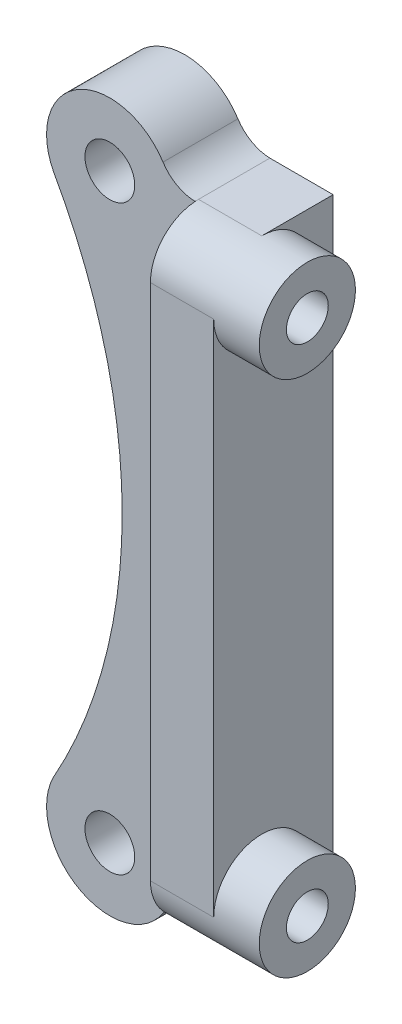
ISO-10303-21;
HEADER;
FILE_DESCRIPTION(('STEP AP214'),'2;1');
FILE_NAME('part.step','',(''),(''),'','','');
FILE_SCHEMA(('AUTOMOTIVE_DESIGN { 1 0 10303 214 1 1 1 1 }'));
ENDSEC;
DATA;
#1=APPLICATION_CONTEXT('core data for automotive mechanical design processes');
#2=APPLICATION_PROTOCOL_DEFINITION('international standard','automotive_design',2000,#1);
#3=PRODUCT_CONTEXT('',#1,'mechanical');
#4=PRODUCT('Part','Part','',(#3));
#5=PRODUCT_RELATED_PRODUCT_CATEGORY('part','',(#4));
#6=PRODUCT_DEFINITION_FORMATION('','',#4);
#7=PRODUCT_DEFINITION_CONTEXT('part definition',#1,'design');
#8=PRODUCT_DEFINITION('design','',#6,#7);
#9=PRODUCT_DEFINITION_SHAPE('','',#8);
#10=(LENGTH_UNIT() NAMED_UNIT(*) SI_UNIT(.MILLI.,.METRE.));
#11=(NAMED_UNIT(*) PLANE_ANGLE_UNIT() SI_UNIT($,.RADIAN.));
#12=(NAMED_UNIT(*) SI_UNIT($,.STERADIAN.) SOLID_ANGLE_UNIT());
#13=UNCERTAINTY_MEASURE_WITH_UNIT(LENGTH_MEASURE(1.E-05),#10,'distance_accuracy_value','');
#14=(GEOMETRIC_REPRESENTATION_CONTEXT(3) GLOBAL_UNCERTAINTY_ASSIGNED_CONTEXT((#13)) GLOBAL_UNIT_ASSIGNED_CONTEXT((#10,
#11,#12)) REPRESENTATION_CONTEXT('',''));
#15=CARTESIAN_POINT('',(0.,0.,0.));
#16=DIRECTION('',(0.,0.,1.));
#17=DIRECTION('',(1.,0.,0.));
#18=AXIS2_PLACEMENT_3D('',#15,#16,#17);
#19=CARTESIAN_POINT('',(27.305,-64.9986,0.));
#20=DIRECTION('',(1.,0.,0.));
#21=DIRECTION('',(0.,0.,-1.));
#22=AXIS2_PLACEMENT_3D('',#19,#20,#21);
#23=PLANE('',#22);
#24=CARTESIAN_POINT('',(27.305,-64.9986,0.));
#25=DIRECTION('',(-1.,0.,0.));
#26=DIRECTION('',(0.,0.,-1.));
#27=AXIS2_PLACEMENT_3D('',#24,#25,#26);
#28=CIRCLE('',#27,12.065);
#29=CARTESIAN_POINT('',(27.305,-64.9986,-12.065));
#30=VERTEX_POINT('',#29);
#31=EDGE_CURVE('E195',#30,#30,#28,.T.);
#32=ORIENTED_EDGE('',*,*,#31,.F.);
#33=EDGE_LOOP('',(#32));
#34=FACE_BOUND('',#33,.T.);
#35=CARTESIAN_POINT('',(27.305,-64.9986,0.));
#36=DIRECTION('',(-1.,0.,0.));
#37=DIRECTION('',(0.,0.,-1.));
#38=AXIS2_PLACEMENT_3D('',#35,#36,#37);
#39=CIRCLE('',#38,5.25018);
#40=CARTESIAN_POINT('',(27.305,-64.9986,-5.25018));
#41=VERTEX_POINT('',#40);
#42=EDGE_CURVE('E521',#41,#41,#39,.T.);
#43=ORIENTED_EDGE('',*,*,#42,.T.);
#44=EDGE_LOOP('',(#43));
#45=FACE_BOUND('',#44,.T.);
#46=ADVANCED_FACE('F31',(#34,#45),#23,.T.);
#47=CARTESIAN_POINT('',(15.875,-77.0636,-17.907));
#48=DIRECTION('',(0.,0.,1.));
#49=DIRECTION('',(1.,0.,0.));
#50=AXIS2_PLACEMENT_3D('',#47,#48,#49);
#51=PLANE('',#50);
#52=DIRECTION('',(-1.,0.,0.));
#53=VECTOR('',#52,1.);
#54=CARTESIAN_POINT('',(15.875,-77.0636,-17.907));
#55=LINE('',#54,#53);
#56=CARTESIAN_POINT('',(15.875,-77.0636,-17.907));
#57=VERTEX_POINT('',#56);
#58=CARTESIAN_POINT('',(0.,-77.0636,-17.907));
#59=VERTEX_POINT('',#58);
#60=EDGE_CURVE('E269',#57,#59,#55,.T.);
#61=ORIENTED_EDGE('',*,*,#60,.T.);
#62=CARTESIAN_POINT('',(0.304239616629049,-86.9551981825839,-17.907));
#63=DIRECTION('',(0.,0.,-1.));
#64=DIRECTION('',(-1.,0.,0.));
#65=AXIS2_PLACEMENT_3D('',#62,#63,#64);
#66=CIRCLE('',#65,9.89627588287756);
#67=CARTESIAN_POINT('',(-8.01545506203511,-81.5961911100162,-17.907));
#68=VERTEX_POINT('',#67);
#69=EDGE_CURVE('E178',#59,#68,#66,.F.);
#70=ORIENTED_EDGE('',*,*,#69,.T.);
#71=CARTESIAN_POINT('',(-21.3614,-72.9996,-17.907));
#72=DIRECTION('',(0.,0.,-1.));
#73=DIRECTION('',(-1.,0.,0.));
#74=AXIS2_PLACEMENT_3D('',#71,#72,#73);
#75=CIRCLE('',#74,15.875);
#76=CARTESIAN_POINT('',(-35.4880712580159,-65.7571705617556,-17.907));
#77=VERTEX_POINT('',#76);
#78=EDGE_CURVE('E140',#68,#77,#75,.T.);
#79=ORIENTED_EDGE('',*,*,#78,.T.);
#80=CARTESIAN_POINT('',(-152.4,0.,-17.907));
#81=DIRECTION('',(0.,0.,-1.));
#82=DIRECTION('',(-1.,0.,0.));
#83=AXIS2_PLACEMENT_3D('',#80,#81,#82);
#84=CIRCLE('',#83,134.135769138804);
#85=CARTESIAN_POINT('',(-35.4880712580154,65.7571705617547,-17.907));
#86=VERTEX_POINT('',#85);
#87=EDGE_CURVE('E181',#86,#77,#84,.T.);
#88=ORIENTED_EDGE('',*,*,#87,.F.);
#89=CARTESIAN_POINT('',(-21.3614,72.9996,-17.907));
#90=DIRECTION('',(0.,0.,-1.));
#91=DIRECTION('',(-1.,0.,0.));
#92=AXIS2_PLACEMENT_3D('',#89,#90,#91);
#93=CIRCLE('',#92,15.875);
#94=CARTESIAN_POINT('',(-8.01545506203512,81.5961911100162,-17.907));
#95=VERTEX_POINT('',#94);
#96=EDGE_CURVE('E166',#86,#95,#93,.T.);
#97=ORIENTED_EDGE('',*,*,#96,.T.);
#98=CARTESIAN_POINT('',(0.304239616629049,86.9551981825839,-17.907));
#99=DIRECTION('',(0.,0.,-1.));
#100=DIRECTION('',(-1.,0.,0.));
#101=AXIS2_PLACEMENT_3D('',#98,#99,#100);
#102=CIRCLE('',#101,9.89627588287755);
#103=CARTESIAN_POINT('',(0.,77.0636,-17.907));
#104=VERTEX_POINT('',#103);
#105=EDGE_CURVE('E163',#104,#95,#102,.T.);
#106=ORIENTED_EDGE('',*,*,#105,.F.);
#107=DIRECTION('',(-1.,0.,0.));
#108=VECTOR('',#107,1.);
#109=CARTESIAN_POINT('',(15.875,77.0636,-17.907));
#110=LINE('',#109,#108);
#111=CARTESIAN_POINT('',(15.875,77.0636,-17.907));
#112=VERTEX_POINT('',#111);
#113=EDGE_CURVE('E238',#112,#104,#110,.T.);
#114=ORIENTED_EDGE('',*,*,#113,.F.);
#115=DIRECTION('',(0.,1.,0.));
#116=VECTOR('',#115,1.);
#117=CARTESIAN_POINT('',(15.875,-77.0636,-17.907));
#118=LINE('',#117,#116);
#119=EDGE_CURVE('E92',#57,#112,#118,.T.);
#120=ORIENTED_EDGE('',*,*,#119,.F.);
#121=EDGE_LOOP('',(#61,#70,#79,#88,#97,#106,#114,#120));
#122=FACE_BOUND('',#121,.T.);
#123=CARTESIAN_POINT('',(-21.3614,72.9996,-17.907));
#124=DIRECTION('',(0.,0.,1.));
#125=DIRECTION('',(1.,0.,0.));
#126=AXIS2_PLACEMENT_3D('',#123,#124,#125);
#127=CIRCLE('',#126,6.2484);
#128=CARTESIAN_POINT('',(-15.113,72.9996,-17.907));
#129=VERTEX_POINT('',#128);
#130=EDGE_CURVE('E169',#129,#129,#127,.T.);
#131=ORIENTED_EDGE('',*,*,#130,.T.);
#132=EDGE_LOOP('',(#131));
#133=FACE_BOUND('',#132,.T.);
#134=CARTESIAN_POINT('',(-21.3614,-72.9996,-17.907));
#135=DIRECTION('',(0.,0.,1.));
#136=DIRECTION('',(1.,0.,0.));
#137=AXIS2_PLACEMENT_3D('',#134,#135,#136);
#138=CIRCLE('',#137,6.2484);
#139=CARTESIAN_POINT('',(-15.113,-72.9996,-17.907));
#140=VERTEX_POINT('',#139);
#141=EDGE_CURVE('E524',#140,#140,#138,.F.);
#142=ORIENTED_EDGE('',*,*,#141,.F.);
#143=EDGE_LOOP('',(#142));
#144=FACE_BOUND('',#143,.T.);
#145=ADVANCED_FACE('F266',(#122,#133,#144),#51,.F.);
#146=CARTESIAN_POINT('',(-155.118473842754,0.,0.889000000000001));
#147=DIRECTION('',(0.,0.,-1.));
#148=DIRECTION('',(-1.,0.,0.));
#149=AXIS2_PLACEMENT_3D('',#146,#147,#148);
#150=PLANE('',#149);
#151=CARTESIAN_POINT('',(0.304239616629049,-86.9551981825839,0.889000000000001));
#152=DIRECTION('',(0.,0.,-1.));
#153=DIRECTION('',(-1.,0.,0.));
#154=AXIS2_PLACEMENT_3D('',#151,#152,#153);
#155=CIRCLE('',#154,9.89627588287756);
#156=CARTESIAN_POINT('',(0.,-77.0636,0.889000000000001));
#157=VERTEX_POINT('',#156);
#158=CARTESIAN_POINT('',(-8.01545506203511,-81.5961911100162,0.889000000000001));
#159=VERTEX_POINT('',#158);
#160=EDGE_CURVE('E152',#157,#159,#155,.F.);
#161=ORIENTED_EDGE('',*,*,#160,.F.);
#162=DIRECTION('',(0.,1.,0.));
#163=VECTOR('',#162,1.);
#164=CARTESIAN_POINT('',(0.,0.,0.889000000000001));
#165=LINE('',#164,#163);
#166=CARTESIAN_POINT('',(0.,-77.0308027908442,0.889000000000001));
#167=VERTEX_POINT('',#166);
#168=EDGE_CURVE('E43',#157,#167,#165,.T.);
#169=ORIENTED_EDGE('',*,*,#168,.T.);
#170=CARTESIAN_POINT('',(0.,77.0308027908442,0.889000000000001));
#171=VERTEX_POINT('',#170);
#172=EDGE_CURVE('E11',#167,#171,#165,.T.);
#173=ORIENTED_EDGE('',*,*,#172,.T.);
#174=CARTESIAN_POINT('',(0.,77.0636,0.889000000000001));
#175=VERTEX_POINT('',#174);
#176=EDGE_CURVE('E44',#171,#175,#165,.T.);
#177=ORIENTED_EDGE('',*,*,#176,.T.);
#178=CARTESIAN_POINT('',(0.304239616629049,86.9551981825839,0.889000000000001));
#179=DIRECTION('',(0.,0.,-1.));
#180=DIRECTION('',(-1.,0.,0.));
#181=AXIS2_PLACEMENT_3D('',#178,#179,#180);
#182=CIRCLE('',#181,9.89627588287755);
#183=CARTESIAN_POINT('',(-8.01545506203512,81.5961911100162,0.889000000000001));
#184=VERTEX_POINT('',#183);
#185=EDGE_CURVE('E176',#175,#184,#182,.T.);
#186=ORIENTED_EDGE('',*,*,#185,.T.);
#187=CARTESIAN_POINT('',(-21.3614,72.9996,0.889000000000001));
#188=DIRECTION('',(0.,0.,-1.));
#189=DIRECTION('',(-1.,0.,0.));
#190=AXIS2_PLACEMENT_3D('',#187,#188,#189);
#191=CIRCLE('',#190,15.875);
#192=CARTESIAN_POINT('',(-35.4880712580154,65.7571705617547,0.889000000000001));
#193=VERTEX_POINT('',#192);
#194=EDGE_CURVE('E173',#193,#184,#191,.T.);
#195=ORIENTED_EDGE('',*,*,#194,.F.);
#196=CARTESIAN_POINT('',(-152.4,0.,0.889000000000001));
#197=DIRECTION('',(0.,0.,-1.));
#198=DIRECTION('',(-1.,0.,0.));
#199=AXIS2_PLACEMENT_3D('',#196,#197,#198);
#200=CIRCLE('',#199,134.135769138804);
#201=CARTESIAN_POINT('',(-35.4880712580159,-65.7571705617556,0.889000000000001));
#202=VERTEX_POINT('',#201);
#203=EDGE_CURVE('E155',#193,#202,#200,.T.);
#204=ORIENTED_EDGE('',*,*,#203,.T.);
#205=CARTESIAN_POINT('',(-21.3614,-72.9996,0.889000000000001));
#206=DIRECTION('',(0.,0.,-1.));
#207=DIRECTION('',(-1.,0.,0.));
#208=AXIS2_PLACEMENT_3D('',#205,#206,#207);
#209=CIRCLE('',#208,15.875);
#210=EDGE_CURVE('E138',#159,#202,#209,.T.);
#211=ORIENTED_EDGE('',*,*,#210,.F.);
#212=EDGE_LOOP('',(#161,#169,#173,#177,#186,#195,#204,#211));
#213=FACE_BOUND('',#212,.T.);
#214=CARTESIAN_POINT('',(-21.3614,72.9996,0.889000000000001));
#215=DIRECTION('',(0.,0.,1.));
#216=DIRECTION('',(1.,0.,0.));
#217=AXIS2_PLACEMENT_3D('',#214,#215,#216);
#218=CIRCLE('',#217,6.2484);
#219=CARTESIAN_POINT('',(-15.113,72.9996,0.889000000000001));
#220=VERTEX_POINT('',#219);
#221=EDGE_CURVE('E535',#220,#220,#218,.T.);
#222=ORIENTED_EDGE('',*,*,#221,.F.);
#223=EDGE_LOOP('',(#222));
#224=FACE_BOUND('',#223,.T.);
#225=CARTESIAN_POINT('',(-21.3614,-72.9996,0.889000000000001));
#226=DIRECTION('',(0.,0.,-1.));
#227=DIRECTION('',(1.,0.,0.));
#228=AXIS2_PLACEMENT_3D('',#225,#226,#227);
#229=CIRCLE('',#228,6.2484);
#230=CARTESIAN_POINT('',(-15.113,-72.9996,0.889000000000001));
#231=VERTEX_POINT('',#230);
#232=EDGE_CURVE('E520',#231,#231,#229,.T.);
#233=ORIENTED_EDGE('',*,*,#232,.T.);
#234=EDGE_LOOP('',(#233));
#235=FACE_BOUND('',#234,.T.);
#236=ADVANCED_FACE('F149',(#213,#224,#235),#150,.F.);
#237=CARTESIAN_POINT('',(15.875,-64.9986,0.));
#238=DIRECTION('',(-1.,0.,0.));
#239=DIRECTION('',(0.,0.,1.));
#240=AXIS2_PLACEMENT_3D('',#237,#238,#239);
#241=PLANE('',#240);
#242=DIRECTION('',(0.,-1.,0.));
#243=VECTOR('',#242,1.);
#244=CARTESIAN_POINT('',(15.875,-64.9986,12.065));
#245=LINE('',#244,#243);
#246=CARTESIAN_POINT('',(15.875,64.9986,12.065));
#247=VERTEX_POINT('',#246);
#248=CARTESIAN_POINT('',(15.875,-64.9986,12.065));
#249=VERTEX_POINT('',#248);
#250=EDGE_CURVE('E58',#247,#249,#245,.T.);
#251=ORIENTED_EDGE('',*,*,#250,.T.);
#252=CARTESIAN_POINT('',(15.875,-64.9986,0.));
#253=DIRECTION('',(-1.,0.,0.));
#254=DIRECTION('',(0.,0.,-1.));
#255=AXIS2_PLACEMENT_3D('',#252,#253,#254);
#256=CIRCLE('',#255,12.065);
#257=CARTESIAN_POINT('',(15.875,-77.0636,0.));
#258=VERTEX_POINT('',#257);
#259=EDGE_CURVE('E193',#249,#258,#256,.T.);
#260=ORIENTED_EDGE('',*,*,#259,.T.);
#261=DIRECTION('',(0.,0.,-1.));
#262=VECTOR('',#261,1.);
#263=CARTESIAN_POINT('',(15.875,-77.0636,-17.907));
#264=LINE('',#263,#262);
#265=EDGE_CURVE('E203',#258,#57,#264,.T.);
#266=ORIENTED_EDGE('',*,*,#265,.T.);
#267=ORIENTED_EDGE('',*,*,#119,.T.);
#268=DIRECTION('',(0.,0.,1.));
#269=VECTOR('',#268,1.);
#270=CARTESIAN_POINT('',(15.875,77.0636,-17.907));
#271=LINE('',#270,#269);
#272=CARTESIAN_POINT('',(15.875,77.0636,0.));
#273=VERTEX_POINT('',#272);
#274=EDGE_CURVE('E206',#112,#273,#271,.T.);
#275=ORIENTED_EDGE('',*,*,#274,.T.);
#276=CARTESIAN_POINT('',(15.875,64.9986,0.));
#277=DIRECTION('',(1.,0.,0.));
#278=DIRECTION('',(0.,0.,-1.));
#279=AXIS2_PLACEMENT_3D('',#276,#277,#278);
#280=CIRCLE('',#279,12.065);
#281=EDGE_CURVE('E41',#247,#273,#280,.T.);
#282=ORIENTED_EDGE('',*,*,#281,.F.);
#283=EDGE_LOOP('',(#251,#260,#266,#267,#275,#282));
#284=FACE_BOUND('',#283,.T.);
#285=ADVANCED_FACE('F318',(#284),#241,.F.);
#286=CARTESIAN_POINT('',(15.875,-77.0636,-17.907));
#287=DIRECTION('',(0.,1.,0.));
#288=DIRECTION('',(0.,0.,1.));
#289=AXIS2_PLACEMENT_3D('',#286,#287,#288);
#290=PLANE('',#289);
#291=DIRECTION('',(0.,0.,-1.));
#292=VECTOR('',#291,1.);
#293=CARTESIAN_POINT('',(0.,-77.0636,-17.907));
#294=LINE('',#293,#292);
#295=CARTESIAN_POINT('',(0.,-77.0636,0.));
#296=VERTEX_POINT('',#295);
#297=EDGE_CURVE('E202',#296,#59,#294,.T.);
#298=ORIENTED_EDGE('',*,*,#297,.T.);
#299=ORIENTED_EDGE('',*,*,#60,.F.);
#300=ORIENTED_EDGE('',*,*,#265,.F.);
#301=DIRECTION('',(-1.,0.,0.));
#302=VECTOR('',#301,1.);
#303=CARTESIAN_POINT('',(15.875,-77.0636,0.));
#304=LINE('',#303,#302);
#305=EDGE_CURVE('E222',#258,#296,#304,.T.);
#306=ORIENTED_EDGE('',*,*,#305,.T.);
#307=EDGE_LOOP('',(#298,#299,#300,#306));
#308=FACE_BOUND('',#307,.T.);
#309=ADVANCED_FACE('F33',(#308),#290,.F.);
#310=CARTESIAN_POINT('',(15.875,77.0636,-17.907));
#311=DIRECTION('',(0.,-1.,0.));
#312=DIRECTION('',(0.,0.,-1.));
#313=AXIS2_PLACEMENT_3D('',#310,#311,#312);
#314=PLANE('',#313);
#315=DIRECTION('',(0.,0.,1.));
#316=VECTOR('',#315,1.);
#317=CARTESIAN_POINT('',(0.,77.0636,-17.907));
#318=LINE('',#317,#316);
#319=CARTESIAN_POINT('',(0.,77.0636,0.));
#320=VERTEX_POINT('',#319);
#321=EDGE_CURVE('E210',#104,#320,#318,.T.);
#322=ORIENTED_EDGE('',*,*,#321,.T.);
#323=DIRECTION('',(-1.,0.,0.));
#324=VECTOR('',#323,1.);
#325=CARTESIAN_POINT('',(15.875,77.0636,0.));
#326=LINE('',#325,#324);
#327=EDGE_CURVE('E236',#273,#320,#326,.T.);
#328=ORIENTED_EDGE('',*,*,#327,.F.);
#329=ORIENTED_EDGE('',*,*,#274,.F.);
#330=ORIENTED_EDGE('',*,*,#113,.T.);
#331=EDGE_LOOP('',(#322,#328,#329,#330));
#332=FACE_BOUND('',#331,.T.);
#333=ADVANCED_FACE('F234',(#332),#314,.F.);
#334=CARTESIAN_POINT('',(15.875,64.9986,0.));
#335=DIRECTION('',(-1.,0.,0.));
#336=DIRECTION('',(0.,0.,1.));
#337=AXIS2_PLACEMENT_3D('',#334,#335,#336);
#338=CYLINDRICAL_SURFACE('',#337,12.065);
#339=CARTESIAN_POINT('',(0.,64.9986,0.));
#340=DIRECTION('',(1.,0.,0.));
#341=DIRECTION('',(0.,0.,-1.));
#342=AXIS2_PLACEMENT_3D('',#339,#340,#341);
#343=CIRCLE('',#342,12.065);
#344=EDGE_CURVE('E35',#320,#171,#343,.T.);
#345=ORIENTED_EDGE('',*,*,#344,.T.);
#346=CARTESIAN_POINT('',(0.,64.9986,12.065));
#347=VERTEX_POINT('',#346);
#348=EDGE_CURVE('E207',#171,#347,#343,.T.);
#349=ORIENTED_EDGE('',*,*,#348,.T.);
#350=DIRECTION('',(-1.,0.,0.));
#351=VECTOR('',#350,1.);
#352=CARTESIAN_POINT('',(15.875,64.9986,12.065));
#353=LINE('',#352,#351);
#354=EDGE_CURVE('E248',#247,#347,#353,.T.);
#355=ORIENTED_EDGE('',*,*,#354,.F.);
#356=ORIENTED_EDGE('',*,*,#281,.T.);
#357=ORIENTED_EDGE('',*,*,#327,.T.);
#358=EDGE_LOOP('',(#345,#349,#355,#356,#357));
#359=FACE_BOUND('',#358,.T.);
#360=CARTESIAN_POINT('',(27.305,64.9986,0.));
#361=DIRECTION('',(1.,0.,0.));
#362=DIRECTION('',(0.,0.,-1.));
#363=AXIS2_PLACEMENT_3D('',#360,#361,#362);
#364=CIRCLE('',#363,12.065);
#365=CARTESIAN_POINT('',(27.305,64.9986,-12.065));
#366=VERTEX_POINT('',#365);
#367=EDGE_CURVE('E198',#366,#366,#364,.T.);
#368=ORIENTED_EDGE('',*,*,#367,.F.);
#369=EDGE_LOOP('',(#368));
#370=FACE_BOUND('',#369,.T.);
#371=ADVANCED_FACE('F245',(#359,#370),#338,.T.);
#372=CARTESIAN_POINT('',(15.875,-64.9986,12.065));
#373=DIRECTION('',(0.,0.,-1.));
#374=DIRECTION('',(-1.,0.,0.));
#375=AXIS2_PLACEMENT_3D('',#372,#373,#374);
#376=PLANE('',#375);
#377=DIRECTION('',(0.,-1.,0.));
#378=VECTOR('',#377,1.);
#379=CARTESIAN_POINT('',(0.,-64.9986,12.065));
#380=LINE('',#379,#378);
#381=CARTESIAN_POINT('',(0.,-64.9986,12.065));
#382=VERTEX_POINT('',#381);
#383=EDGE_CURVE('E211',#347,#382,#380,.T.);
#384=ORIENTED_EDGE('',*,*,#383,.T.);
#385=DIRECTION('',(-1.,0.,0.));
#386=VECTOR('',#385,1.);
#387=CARTESIAN_POINT('',(15.875,-64.9986,12.065));
#388=LINE('',#387,#386);
#389=EDGE_CURVE('E215',#249,#382,#388,.T.);
#390=ORIENTED_EDGE('',*,*,#389,.F.);
#391=ORIENTED_EDGE('',*,*,#250,.F.);
#392=ORIENTED_EDGE('',*,*,#354,.T.);
#393=EDGE_LOOP('',(#384,#390,#391,#392));
#394=FACE_BOUND('',#393,.T.);
#395=ADVANCED_FACE('F294',(#394),#376,.F.);
#396=CARTESIAN_POINT('',(15.875,-64.9986,0.));
#397=DIRECTION('',(-1.,0.,0.));
#398=DIRECTION('',(0.,0.,1.));
#399=AXIS2_PLACEMENT_3D('',#396,#397,#398);
#400=CYLINDRICAL_SURFACE('',#399,12.065);
#401=CARTESIAN_POINT('',(0.,-64.9986,0.));
#402=DIRECTION('',(1.,0.,0.));
#403=DIRECTION('',(0.,0.,1.));
#404=AXIS2_PLACEMENT_3D('',#401,#402,#403);
#405=CIRCLE('',#404,12.065);
#406=EDGE_CURVE('E205',#382,#167,#405,.T.);
#407=ORIENTED_EDGE('',*,*,#406,.T.);
#408=EDGE_CURVE('E85',#167,#296,#405,.T.);
#409=ORIENTED_EDGE('',*,*,#408,.T.);
#410=ORIENTED_EDGE('',*,*,#305,.F.);
#411=ORIENTED_EDGE('',*,*,#259,.F.);
#412=ORIENTED_EDGE('',*,*,#389,.T.);
#413=EDGE_LOOP('',(#407,#409,#410,#411,#412));
#414=FACE_BOUND('',#413,.T.);
#415=ORIENTED_EDGE('',*,*,#31,.T.);
#416=EDGE_LOOP('',(#415));
#417=FACE_BOUND('',#416,.T.);
#418=ADVANCED_FACE('F291',(#414,#417),#400,.T.);
#419=CARTESIAN_POINT('',(0.,-64.9986,0.));
#420=DIRECTION('',(-1.,0.,0.));
#421=DIRECTION('',(0.,0.,1.));
#422=AXIS2_PLACEMENT_3D('',#419,#420,#421);
#423=PLANE('',#422);
#424=ORIENTED_EDGE('',*,*,#172,.F.);
#425=ORIENTED_EDGE('',*,*,#406,.F.);
#426=ORIENTED_EDGE('',*,*,#383,.F.);
#427=ORIENTED_EDGE('',*,*,#348,.F.);
#428=EDGE_LOOP('',(#424,#425,#426,#427));
#429=FACE_BOUND('',#428,.T.);
#430=ADVANCED_FACE('F293',(#429),#423,.T.);
#431=CARTESIAN_POINT('',(27.305,64.9986,0.));
#432=DIRECTION('',(1.,0.,0.));
#433=DIRECTION('',(0.,0.,-1.));
#434=AXIS2_PLACEMENT_3D('',#431,#432,#433);
#435=PLANE('',#434);
#436=CARTESIAN_POINT('',(27.305,64.9986,0.));
#437=DIRECTION('',(1.,0.,0.));
#438=DIRECTION('',(0.,0.,-1.));
#439=AXIS2_PLACEMENT_3D('',#436,#437,#438);
#440=CIRCLE('',#439,5.25018);
#441=CARTESIAN_POINT('',(27.305,64.9986,-5.25018));
#442=VERTEX_POINT('',#441);
#443=EDGE_CURVE('E531',#442,#442,#440,.T.);
#444=ORIENTED_EDGE('',*,*,#443,.F.);
#445=EDGE_LOOP('',(#444));
#446=FACE_BOUND('',#445,.T.);
#447=ORIENTED_EDGE('',*,*,#367,.T.);
#448=EDGE_LOOP('',(#447));
#449=FACE_BOUND('',#448,.T.);
#450=ADVANCED_FACE('F314',(#446,#449),#435,.T.);
#451=CARTESIAN_POINT('',(0.,0.,0.889000000000001));
#452=DIRECTION('',(-1.,0.,0.));
#453=DIRECTION('',(0.,0.,1.));
#454=AXIS2_PLACEMENT_3D('',#451,#452,#453);
#455=PLANE('',#454);
#456=ORIENTED_EDGE('',*,*,#408,.F.);
#457=ORIENTED_EDGE('',*,*,#168,.F.);
#458=DIRECTION('',(0.,0.,-1.));
#459=VECTOR('',#458,1.);
#460=CARTESIAN_POINT('',(0.,-77.0636,0.889000000000001));
#461=LINE('',#460,#459);
#462=EDGE_CURVE('E161',#157,#296,#461,.T.);
#463=ORIENTED_EDGE('',*,*,#462,.T.);
#464=EDGE_LOOP('',(#456,#457,#463));
#465=FACE_BOUND('',#464,.T.);
#466=ADVANCED_FACE('F272',(#465),#455,.F.);
#467=CARTESIAN_POINT('',(0.304239616629049,-86.9551981825839,0.889000000000001));
#468=DIRECTION('',(0.,0.,-1.));
#469=DIRECTION('',(-1.,0.,0.));
#470=AXIS2_PLACEMENT_3D('',#467,#468,#469);
#471=CYLINDRICAL_SURFACE('',#470,9.89627588287756);
#472=ORIENTED_EDGE('',*,*,#69,.F.);
#473=ORIENTED_EDGE('',*,*,#297,.F.);
#474=ORIENTED_EDGE('',*,*,#462,.F.);
#475=ORIENTED_EDGE('',*,*,#160,.T.);
#476=DIRECTION('',(0.,0.,-1.));
#477=VECTOR('',#476,1.);
#478=CARTESIAN_POINT('',(-8.01545506203511,-81.5961911100162,0.889000000000001));
#479=LINE('',#478,#477);
#480=EDGE_CURVE('E135',#159,#68,#479,.T.);
#481=ORIENTED_EDGE('',*,*,#480,.T.);
#482=EDGE_LOOP('',(#472,#473,#474,#475,#481));
#483=FACE_BOUND('',#482,.T.);
#484=ADVANCED_FACE('F158',(#483),#471,.F.);
#485=ORIENTED_EDGE('',*,*,#344,.F.);
#486=DIRECTION('',(0.,0.,-1.));
#487=VECTOR('',#486,1.);
#488=CARTESIAN_POINT('',(0.,77.0636,0.889000000000001));
#489=LINE('',#488,#487);
#490=EDGE_CURVE('E194',#175,#320,#489,.T.);
#491=ORIENTED_EDGE('',*,*,#490,.F.);
#492=ORIENTED_EDGE('',*,*,#176,.F.);
#493=EDGE_LOOP('',(#485,#491,#492));
#494=FACE_BOUND('',#493,.T.);
#495=ADVANCED_FACE('F253',(#494),#455,.F.);
#496=CARTESIAN_POINT('',(0.304239616629049,86.9551981825839,0.889000000000001));
#497=DIRECTION('',(0.,0.,-1.));
#498=DIRECTION('',(-1.,0.,0.));
#499=AXIS2_PLACEMENT_3D('',#496,#497,#498);
#500=CYLINDRICAL_SURFACE('',#499,9.89627588287755);
#501=ORIENTED_EDGE('',*,*,#105,.T.);
#502=DIRECTION('',(0.,0.,-1.));
#503=VECTOR('',#502,1.);
#504=CARTESIAN_POINT('',(-8.01545506203512,81.5961911100162,0.889000000000001));
#505=LINE('',#504,#503);
#506=EDGE_CURVE('E257',#184,#95,#505,.T.);
#507=ORIENTED_EDGE('',*,*,#506,.F.);
#508=ORIENTED_EDGE('',*,*,#185,.F.);
#509=ORIENTED_EDGE('',*,*,#490,.T.);
#510=ORIENTED_EDGE('',*,*,#321,.F.);
#511=EDGE_LOOP('',(#501,#507,#508,#509,#510));
#512=FACE_BOUND('',#511,.T.);
#513=ADVANCED_FACE('F255',(#512),#500,.F.);
#514=CARTESIAN_POINT('',(-21.3614,72.9996,0.889000000000001));
#515=DIRECTION('',(0.,0.,-1.));
#516=DIRECTION('',(-1.,0.,0.));
#517=AXIS2_PLACEMENT_3D('',#514,#515,#516);
#518=CYLINDRICAL_SURFACE('',#517,15.875);
#519=ORIENTED_EDGE('',*,*,#96,.F.);
#520=DIRECTION('',(0.,0.,-1.));
#521=VECTOR('',#520,1.);
#522=CARTESIAN_POINT('',(-35.4880712580154,65.7571705617547,0.889000000000001));
#523=LINE('',#522,#521);
#524=EDGE_CURVE('E258',#193,#86,#523,.T.);
#525=ORIENTED_EDGE('',*,*,#524,.F.);
#526=ORIENTED_EDGE('',*,*,#194,.T.);
#527=ORIENTED_EDGE('',*,*,#506,.T.);
#528=EDGE_LOOP('',(#519,#525,#526,#527));
#529=FACE_BOUND('',#528,.T.);
#530=ADVANCED_FACE('F273',(#529),#518,.T.);
#531=CARTESIAN_POINT('',(-152.4,0.,0.889000000000001));
#532=DIRECTION('',(0.,0.,-1.));
#533=DIRECTION('',(-1.,0.,0.));
#534=AXIS2_PLACEMENT_3D('',#531,#532,#533);
#535=CYLINDRICAL_SURFACE('',#534,134.135769138804);
#536=ORIENTED_EDGE('',*,*,#87,.T.);
#537=DIRECTION('',(0.,0.,-1.));
#538=VECTOR('',#537,1.);
#539=CARTESIAN_POINT('',(-35.4880712580159,-65.7571705617556,0.889000000000001));
#540=LINE('',#539,#538);
#541=EDGE_CURVE('E145',#202,#77,#540,.T.);
#542=ORIENTED_EDGE('',*,*,#541,.F.);
#543=ORIENTED_EDGE('',*,*,#203,.F.);
#544=ORIENTED_EDGE('',*,*,#524,.T.);
#545=EDGE_LOOP('',(#536,#542,#543,#544));
#546=FACE_BOUND('',#545,.T.);
#547=ADVANCED_FACE('F265',(#546),#535,.F.);
#548=CARTESIAN_POINT('',(-21.3614,-72.9996,0.889000000000001));
#549=DIRECTION('',(0.,0.,-1.));
#550=DIRECTION('',(-1.,0.,0.));
#551=AXIS2_PLACEMENT_3D('',#548,#549,#550);
#552=CYLINDRICAL_SURFACE('',#551,15.875);
#553=ORIENTED_EDGE('',*,*,#78,.F.);
#554=ORIENTED_EDGE('',*,*,#480,.F.);
#555=ORIENTED_EDGE('',*,*,#210,.T.);
#556=ORIENTED_EDGE('',*,*,#541,.T.);
#557=EDGE_LOOP('',(#553,#554,#555,#556));
#558=FACE_BOUND('',#557,.T.);
#559=ADVANCED_FACE('F137',(#558),#552,.T.);
#560=CARTESIAN_POINT('',(-21.3614,72.9996,-17.907025));
#561=DIRECTION('',(0.,0.,1.));
#562=DIRECTION('',(1.,0.,0.));
#563=AXIS2_PLACEMENT_3D('',#560,#561,#562);
#564=CYLINDRICAL_SURFACE('',#563,6.2484);
#565=ORIENTED_EDGE('',*,*,#221,.T.);
#566=EDGE_LOOP('',(#565));
#567=FACE_BOUND('',#566,.T.);
#568=ORIENTED_EDGE('',*,*,#130,.F.);
#569=EDGE_LOOP('',(#568));
#570=FACE_BOUND('',#569,.T.);
#571=ADVANCED_FACE('F372',(#567,#570),#564,.F.);
#572=CARTESIAN_POINT('',(1.905,64.9986,0.));
#573=DIRECTION('',(1.,0.,0.));
#574=DIRECTION('',(0.,0.,-1.));
#575=AXIS2_PLACEMENT_3D('',#572,#573,#574);
#576=CYLINDRICAL_SURFACE('',#575,5.25018);
#577=CARTESIAN_POINT('',(1.905,64.9986,0.));
#578=DIRECTION('',(1.,0.,0.));
#579=DIRECTION('',(0.,0.,-1.));
#580=AXIS2_PLACEMENT_3D('',#577,#578,#579);
#581=CIRCLE('',#580,5.25018);
#582=CARTESIAN_POINT('',(1.905,64.9986,-5.25018));
#583=VERTEX_POINT('',#582);
#584=EDGE_CURVE('E532',#583,#583,#581,.T.);
#585=ORIENTED_EDGE('',*,*,#584,.F.);
#586=EDGE_LOOP('',(#585));
#587=FACE_BOUND('',#586,.T.);
#588=ORIENTED_EDGE('',*,*,#443,.T.);
#589=EDGE_LOOP('',(#588));
#590=FACE_BOUND('',#589,.T.);
#591=ADVANCED_FACE('F377',(#587,#590),#576,.F.);
#592=CARTESIAN_POINT('',(1.905,64.9986,0.));
#593=DIRECTION('',(1.,0.,0.));
#594=DIRECTION('',(0.,0.,-1.));
#595=AXIS2_PLACEMENT_3D('',#592,#593,#594);
#596=PLANE('',#595);
#597=ORIENTED_EDGE('',*,*,#584,.T.);
#598=EDGE_LOOP('',(#597));
#599=FACE_BOUND('',#598,.T.);
#600=ADVANCED_FACE('F384',(#599),#596,.T.);
#601=CARTESIAN_POINT('',(-21.3614,-72.9996,-17.907025));
#602=DIRECTION('',(0.,0.,1.));
#603=DIRECTION('',(1.,0.,0.));
#604=AXIS2_PLACEMENT_3D('',#601,#602,#603);
#605=CYLINDRICAL_SURFACE('',#604,6.2484);
#606=ORIENTED_EDGE('',*,*,#232,.F.);
#607=EDGE_LOOP('',(#606));
#608=FACE_BOUND('',#607,.T.);
#609=ORIENTED_EDGE('',*,*,#141,.T.);
#610=EDGE_LOOP('',(#609));
#611=FACE_BOUND('',#610,.T.);
#612=ADVANCED_FACE('F392',(#608,#611),#605,.F.);
#613=CARTESIAN_POINT('',(1.905,-64.9986,0.));
#614=DIRECTION('',(1.,0.,0.));
#615=DIRECTION('',(0.,0.,-1.));
#616=AXIS2_PLACEMENT_3D('',#613,#614,#615);
#617=CYLINDRICAL_SURFACE('',#616,5.25018);
#618=CARTESIAN_POINT('',(1.905,-64.9986,0.));
#619=DIRECTION('',(-1.,0.,0.));
#620=DIRECTION('',(0.,0.,-1.));
#621=AXIS2_PLACEMENT_3D('',#618,#619,#620);
#622=CIRCLE('',#621,5.25018);
#623=CARTESIAN_POINT('',(1.905,-64.9986,-5.25018));
#624=VERTEX_POINT('',#623);
#625=EDGE_CURVE('E519',#624,#624,#622,.T.);
#626=ORIENTED_EDGE('',*,*,#625,.T.);
#627=EDGE_LOOP('',(#626));
#628=FACE_BOUND('',#627,.T.);
#629=ORIENTED_EDGE('',*,*,#42,.F.);
#630=EDGE_LOOP('',(#629));
#631=FACE_BOUND('',#630,.T.);
#632=ADVANCED_FACE('F400',(#628,#631),#617,.F.);
#633=CARTESIAN_POINT('',(1.905,-64.9986,0.));
#634=DIRECTION('',(1.,0.,0.));
#635=DIRECTION('',(0.,0.,-1.));
#636=AXIS2_PLACEMENT_3D('',#633,#634,#635);
#637=PLANE('',#636);
#638=ORIENTED_EDGE('',*,*,#625,.F.);
#639=EDGE_LOOP('',(#638));
#640=FACE_BOUND('',#639,.T.);
#641=ADVANCED_FACE('F409',(#640),#637,.T.);
#642=CLOSED_SHELL('',(#46,#145,#236,#285,#309,#333,#371,#395,#418,#430,#450,#466,#484,#495,#513,
#530,#547,#559,#571,#591,#600,#612,#632,#641));
#643=MANIFOLD_SOLID_BREP('B2',#642);
#644=ADVANCED_BREP_SHAPE_REPRESENTATION('',(#18,#643),#14);
#645=SHAPE_DEFINITION_REPRESENTATION(#9,#644);
ENDSEC;
END-ISO-10303-21;
